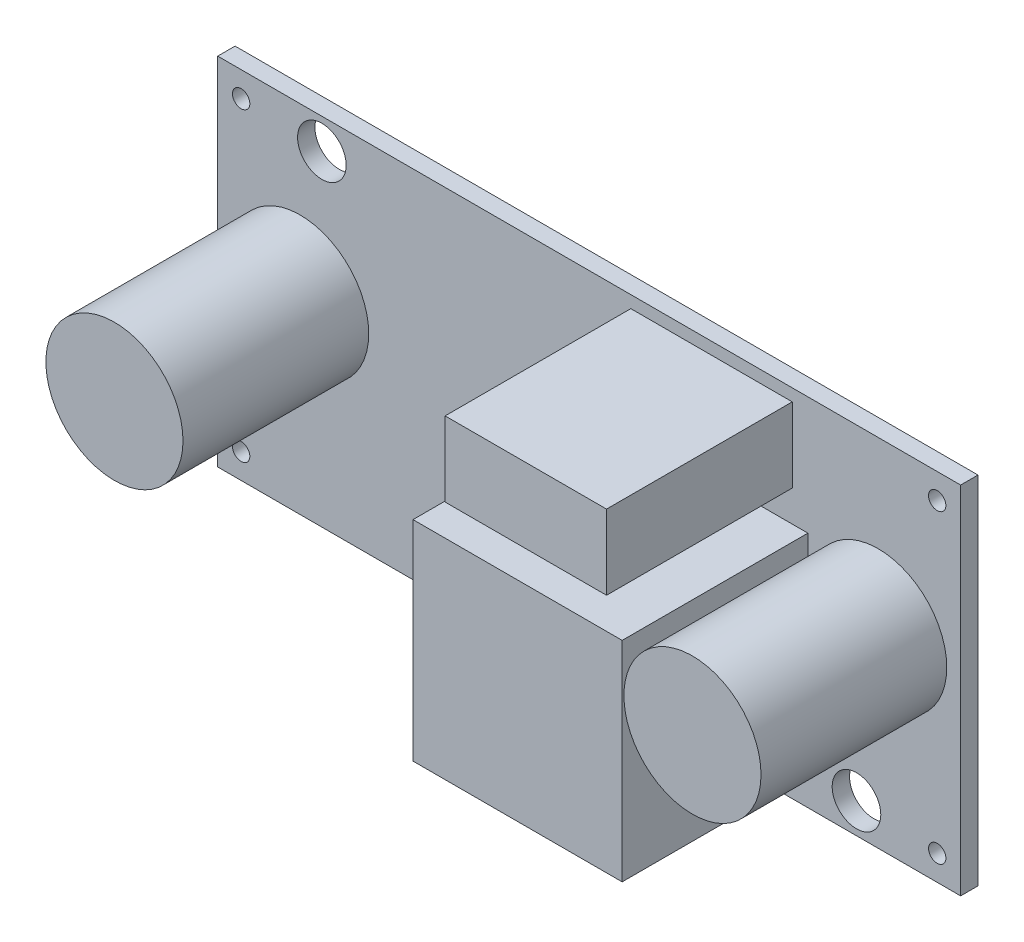
ISO-10303-21;
HEADER;
FILE_DESCRIPTION(('STEP AP214'),'2;1');
FILE_NAME('part.step','',(''),(''),'','','');
FILE_SCHEMA(('AUTOMOTIVE_DESIGN { 1 0 10303 214 1 1 1 1 }'));
ENDSEC;
DATA;
#1=APPLICATION_CONTEXT('core data for automotive mechanical design processes');
#2=APPLICATION_PROTOCOL_DEFINITION('international standard','automotive_design',2000,#1);
#3=PRODUCT_CONTEXT('',#1,'mechanical');
#4=PRODUCT('Part','Part','',(#3));
#5=PRODUCT_RELATED_PRODUCT_CATEGORY('part','',(#4));
#6=PRODUCT_DEFINITION_FORMATION('','',#4);
#7=PRODUCT_DEFINITION_CONTEXT('part definition',#1,'design');
#8=PRODUCT_DEFINITION('design','',#6,#7);
#9=PRODUCT_DEFINITION_SHAPE('','',#8);
#10=(LENGTH_UNIT() NAMED_UNIT(*) SI_UNIT(.MILLI.,.METRE.));
#11=(NAMED_UNIT(*) PLANE_ANGLE_UNIT() SI_UNIT($,.RADIAN.));
#12=(NAMED_UNIT(*) SI_UNIT($,.STERADIAN.) SOLID_ANGLE_UNIT());
#13=UNCERTAINTY_MEASURE_WITH_UNIT(LENGTH_MEASURE(1.E-05),#10,'distance_accuracy_value','');
#14=(GEOMETRIC_REPRESENTATION_CONTEXT(3) GLOBAL_UNCERTAINTY_ASSIGNED_CONTEXT((#13)) GLOBAL_UNIT_ASSIGNED_CONTEXT((#10,
#11,#12)) REPRESENTATION_CONTEXT('',''));
#15=CARTESIAN_POINT('',(0.,0.,0.));
#16=DIRECTION('',(0.,0.,1.));
#17=DIRECTION('',(1.,0.,0.));
#18=AXIS2_PLACEMENT_3D('',#15,#16,#17);
#19=CARTESIAN_POINT('',(0.,0.,1.));
#20=DIRECTION('',(0.,0.,1.));
#21=DIRECTION('',(1.,0.,0.));
#22=AXIS2_PLACEMENT_3D('',#19,#20,#21);
#23=PLANE('',#22);
#24=CARTESIAN_POINT('',(20.05,8.80000000000001,1.));
#25=DIRECTION('',(0.,0.,1.));
#26=DIRECTION('',(1.,0.,0.));
#27=AXIS2_PLACEMENT_3D('',#24,#25,#26);
#28=CIRCLE('',#27,0.499999999999999);
#29=CARTESIAN_POINT('',(20.55,8.80000000000001,1.));
#30=VERTEX_POINT('',#29);
#31=EDGE_CURVE('E398',#30,#30,#28,.T.);
#32=ORIENTED_EDGE('',*,*,#31,.F.);
#33=EDGE_LOOP('',(#32));
#34=FACE_BOUND('',#33,.T.);
#35=CARTESIAN_POINT('',(20.05,-8.8,1.));
#36=DIRECTION('',(0.,0.,1.));
#37=DIRECTION('',(1.,0.,0.));
#38=AXIS2_PLACEMENT_3D('',#35,#36,#37);
#39=CIRCLE('',#38,0.499999999999999);
#40=CARTESIAN_POINT('',(20.55,-8.8,1.));
#41=VERTEX_POINT('',#40);
#42=EDGE_CURVE('E390',#41,#41,#39,.T.);
#43=ORIENTED_EDGE('',*,*,#42,.F.);
#44=EDGE_LOOP('',(#43));
#45=FACE_BOUND('',#44,.T.);
#46=CARTESIAN_POINT('',(-20.05,-8.8,1.));
#47=DIRECTION('',(0.,0.,1.));
#48=DIRECTION('',(1.,0.,0.));
#49=AXIS2_PLACEMENT_3D('',#46,#47,#48);
#50=CIRCLE('',#49,0.499999999999999);
#51=CARTESIAN_POINT('',(-19.55,-8.8,1.));
#52=VERTEX_POINT('',#51);
#53=EDGE_CURVE('E383',#52,#52,#50,.T.);
#54=ORIENTED_EDGE('',*,*,#53,.F.);
#55=EDGE_LOOP('',(#54));
#56=FACE_BOUND('',#55,.T.);
#57=CARTESIAN_POINT('',(-20.05,8.8,1.));
#58=DIRECTION('',(0.,0.,1.));
#59=DIRECTION('',(1.,0.,0.));
#60=AXIS2_PLACEMENT_3D('',#57,#58,#59);
#61=CIRCLE('',#60,0.499999999999999);
#62=CARTESIAN_POINT('',(-19.55,8.8,1.));
#63=VERTEX_POINT('',#62);
#64=EDGE_CURVE('E385',#63,#63,#61,.T.);
#65=ORIENTED_EDGE('',*,*,#64,.F.);
#66=EDGE_LOOP('',(#65));
#67=FACE_BOUND('',#66,.T.);
#68=CARTESIAN_POINT('',(-16.65,0.750000000000004,1.));
#69=DIRECTION('',(0.,0.,1.));
#70=DIRECTION('',(1.,0.,0.));
#71=AXIS2_PLACEMENT_3D('',#68,#69,#70);
#72=CIRCLE('',#71,3.95);
#73=CARTESIAN_POINT('',(-12.7,0.750000000000004,1.));
#74=VERTEX_POINT('',#73);
#75=EDGE_CURVE('E200',#74,#74,#72,.T.);
#76=ORIENTED_EDGE('',*,*,#75,.F.);
#77=EDGE_LOOP('',(#76));
#78=FACE_BOUND('',#77,.T.);
#79=CARTESIAN_POINT('',(16.65,0.750000000000004,1.));
#80=DIRECTION('',(0.,0.,1.));
#81=DIRECTION('',(1.,0.,0.));
#82=AXIS2_PLACEMENT_3D('',#79,#80,#81);
#83=CIRCLE('',#82,3.95);
#84=CARTESIAN_POINT('',(20.6,0.750000000000004,1.));
#85=VERTEX_POINT('',#84);
#86=EDGE_CURVE('E203',#85,#85,#83,.T.);
#87=ORIENTED_EDGE('',*,*,#86,.F.);
#88=EDGE_LOOP('',(#87));
#89=FACE_BOUND('',#88,.T.);
#90=CARTESIAN_POINT('',(-15.4,8.5,1.));
#91=DIRECTION('',(0.,0.,1.));
#92=DIRECTION('',(1.,0.,0.));
#93=AXIS2_PLACEMENT_3D('',#90,#91,#92);
#94=CIRCLE('',#93,1.4);
#95=CARTESIAN_POINT('',(-14.,8.5,1.));
#96=VERTEX_POINT('',#95);
#97=EDGE_CURVE('E218',#96,#96,#94,.T.);
#98=ORIENTED_EDGE('',*,*,#97,.F.);
#99=EDGE_LOOP('',(#98));
#100=FACE_BOUND('',#99,.T.);
#101=DIRECTION('',(0.,-1.,0.));
#102=VECTOR('',#101,1.);
#103=CARTESIAN_POINT('',(-21.4,-10.25,1.));
#104=LINE('',#103,#102);
#105=CARTESIAN_POINT('',(-21.4,10.25,1.));
#106=VERTEX_POINT('',#105);
#107=CARTESIAN_POINT('',(-21.4,-10.25,1.));
#108=VERTEX_POINT('',#107);
#109=EDGE_CURVE('E224',#106,#108,#104,.T.);
#110=ORIENTED_EDGE('',*,*,#109,.T.);
#111=DIRECTION('',(1.,0.,0.));
#112=VECTOR('',#111,1.);
#113=CARTESIAN_POINT('',(21.4,-10.25,1.));
#114=LINE('',#113,#112);
#115=CARTESIAN_POINT('',(21.4,-10.25,1.));
#116=VERTEX_POINT('',#115);
#117=EDGE_CURVE('E227',#108,#116,#114,.T.);
#118=ORIENTED_EDGE('',*,*,#117,.T.);
#119=DIRECTION('',(0.,1.,0.));
#120=VECTOR('',#119,1.);
#121=CARTESIAN_POINT('',(21.4,-10.25,1.));
#122=LINE('',#121,#120);
#123=CARTESIAN_POINT('',(21.4,10.25,1.));
#124=VERTEX_POINT('',#123);
#125=EDGE_CURVE('E230',#116,#124,#122,.T.);
#126=ORIENTED_EDGE('',*,*,#125,.T.);
#127=DIRECTION('',(-1.,0.,0.));
#128=VECTOR('',#127,1.);
#129=CARTESIAN_POINT('',(21.4,10.25,1.));
#130=LINE('',#129,#128);
#131=EDGE_CURVE('E232',#124,#106,#130,.T.);
#132=ORIENTED_EDGE('',*,*,#131,.T.);
#133=EDGE_LOOP('',(#110,#118,#126,#132));
#134=FACE_BOUND('',#133,.T.);
#135=CARTESIAN_POINT('',(15.4,-8.5,1.));
#136=DIRECTION('',(0.,0.,1.));
#137=DIRECTION('',(1.,0.,0.));
#138=AXIS2_PLACEMENT_3D('',#135,#136,#137);
#139=CIRCLE('',#138,1.4);
#140=CARTESIAN_POINT('',(16.8,-8.5,1.));
#141=VERTEX_POINT('',#140);
#142=EDGE_CURVE('E212',#141,#141,#139,.T.);
#143=ORIENTED_EDGE('',*,*,#142,.F.);
#144=EDGE_LOOP('',(#143));
#145=FACE_BOUND('',#144,.T.);
#146=DIRECTION('',(1.,0.,0.));
#147=VECTOR('',#146,1.);
#148=CARTESIAN_POINT('',(11.7,5.25,1.));
#149=LINE('',#148,#147);
#150=CARTESIAN_POINT('',(2.39999999999999,5.25,1.));
#151=VERTEX_POINT('',#150);
#152=CARTESIAN_POINT('',(11.7,5.25,1.));
#153=VERTEX_POINT('',#152);
#154=EDGE_CURVE('E187',#151,#153,#149,.T.);
#155=ORIENTED_EDGE('',*,*,#154,.F.);
#156=DIRECTION('',(0.,-1.,0.));
#157=VECTOR('',#156,1.);
#158=CARTESIAN_POINT('',(2.39999999999999,9.55,1.));
#159=LINE('',#158,#157);
#160=CARTESIAN_POINT('',(2.39999999999999,9.55,1.));
#161=VERTEX_POINT('',#160);
#162=EDGE_CURVE('E189',#161,#151,#159,.T.);
#163=ORIENTED_EDGE('',*,*,#162,.F.);
#164=DIRECTION('',(-1.,0.,0.));
#165=VECTOR('',#164,1.);
#166=CARTESIAN_POINT('',(11.7,9.55,1.));
#167=LINE('',#166,#165);
#168=CARTESIAN_POINT('',(11.7,9.55,1.));
#169=VERTEX_POINT('',#168);
#170=EDGE_CURVE('E182',#169,#161,#167,.T.);
#171=ORIENTED_EDGE('',*,*,#170,.F.);
#172=DIRECTION('',(0.,1.,0.));
#173=VECTOR('',#172,1.);
#174=CARTESIAN_POINT('',(11.7,9.55,1.));
#175=LINE('',#174,#173);
#176=EDGE_CURVE('E184',#153,#169,#175,.T.);
#177=ORIENTED_EDGE('',*,*,#176,.F.);
#178=EDGE_LOOP('',(#155,#163,#171,#177));
#179=FACE_BOUND('',#178,.T.);
#180=DIRECTION('',(1.,0.,0.));
#181=VECTOR('',#180,1.);
#182=CARTESIAN_POINT('',(12.6,-8.6,1.));
#183=LINE('',#182,#181);
#184=CARTESIAN_POINT('',(0.549999999999993,-8.6,1.));
#185=VERTEX_POINT('',#184);
#186=CARTESIAN_POINT('',(12.6,-8.6,1.));
#187=VERTEX_POINT('',#186);
#188=EDGE_CURVE('E161',#185,#187,#183,.T.);
#189=ORIENTED_EDGE('',*,*,#188,.F.);
#190=DIRECTION('',(0.,-1.,0.));
#191=VECTOR('',#190,1.);
#192=CARTESIAN_POINT('',(0.549999999999991,3.45,1.));
#193=LINE('',#192,#191);
#194=CARTESIAN_POINT('',(0.549999999999991,3.45,1.));
#195=VERTEX_POINT('',#194);
#196=EDGE_CURVE('E156',#195,#185,#193,.T.);
#197=ORIENTED_EDGE('',*,*,#196,.F.);
#198=DIRECTION('',(-1.,0.,0.));
#199=VECTOR('',#198,1.);
#200=CARTESIAN_POINT('',(12.6,3.45,1.));
#201=LINE('',#200,#199);
#202=CARTESIAN_POINT('',(12.6,3.45,1.));
#203=VERTEX_POINT('',#202);
#204=EDGE_CURVE('E141',#203,#195,#201,.T.);
#205=ORIENTED_EDGE('',*,*,#204,.F.);
#206=DIRECTION('',(0.,1.,0.));
#207=VECTOR('',#206,1.);
#208=CARTESIAN_POINT('',(12.6,3.45,1.));
#209=LINE('',#208,#207);
#210=EDGE_CURVE('E149',#187,#203,#209,.T.);
#211=ORIENTED_EDGE('',*,*,#210,.F.);
#212=EDGE_LOOP('',(#189,#197,#205,#211));
#213=FACE_BOUND('',#212,.T.);
#214=ADVANCED_FACE('F51',(#34,#45,#56,#67,#78,#89,#100,#134,#145,#179,#213),#23,.T.);
#215=CARTESIAN_POINT('',(0.,0.,0.));
#216=DIRECTION('',(0.,0.,1.));
#217=DIRECTION('',(1.,0.,0.));
#218=AXIS2_PLACEMENT_3D('',#215,#216,#217);
#219=PLANE('',#218);
#220=CARTESIAN_POINT('',(20.05,8.80000000000001,0.));
#221=DIRECTION('',(0.,0.,1.));
#222=DIRECTION('',(1.,0.,0.));
#223=AXIS2_PLACEMENT_3D('',#220,#221,#222);
#224=CIRCLE('',#223,0.499999999999999);
#225=CARTESIAN_POINT('',(20.55,8.80000000000001,0.));
#226=VERTEX_POINT('',#225);
#227=EDGE_CURVE('E401',#226,#226,#224,.T.);
#228=ORIENTED_EDGE('',*,*,#227,.T.);
#229=EDGE_LOOP('',(#228));
#230=FACE_BOUND('',#229,.T.);
#231=CARTESIAN_POINT('',(20.05,-8.8,0.));
#232=DIRECTION('',(0.,0.,1.));
#233=DIRECTION('',(1.,0.,0.));
#234=AXIS2_PLACEMENT_3D('',#231,#232,#233);
#235=CIRCLE('',#234,0.499999999999999);
#236=CARTESIAN_POINT('',(20.55,-8.8,0.));
#237=VERTEX_POINT('',#236);
#238=EDGE_CURVE('E395',#237,#237,#235,.T.);
#239=ORIENTED_EDGE('',*,*,#238,.T.);
#240=EDGE_LOOP('',(#239));
#241=FACE_BOUND('',#240,.T.);
#242=CARTESIAN_POINT('',(-20.05,-8.8,0.));
#243=DIRECTION('',(0.,0.,1.));
#244=DIRECTION('',(1.,0.,0.));
#245=AXIS2_PLACEMENT_3D('',#242,#243,#244);
#246=CIRCLE('',#245,0.499999999999999);
#247=CARTESIAN_POINT('',(-19.55,-8.8,0.));
#248=VERTEX_POINT('',#247);
#249=EDGE_CURVE('E380',#248,#248,#246,.T.);
#250=ORIENTED_EDGE('',*,*,#249,.T.);
#251=EDGE_LOOP('',(#250));
#252=FACE_BOUND('',#251,.T.);
#253=CARTESIAN_POINT('',(-20.05,8.8,0.));
#254=DIRECTION('',(0.,0.,1.));
#255=DIRECTION('',(1.,0.,0.));
#256=AXIS2_PLACEMENT_3D('',#253,#254,#255);
#257=CIRCLE('',#256,0.499999999999999);
#258=CARTESIAN_POINT('',(-19.55,8.8,0.));
#259=VERTEX_POINT('',#258);
#260=EDGE_CURVE('E388',#259,#259,#257,.T.);
#261=ORIENTED_EDGE('',*,*,#260,.T.);
#262=EDGE_LOOP('',(#261));
#263=FACE_BOUND('',#262,.T.);
#264=DIRECTION('',(0.,-1.,0.));
#265=VECTOR('',#264,1.);
#266=CARTESIAN_POINT('',(-21.4,-10.25,0.));
#267=LINE('',#266,#265);
#268=CARTESIAN_POINT('',(-21.4,10.25,0.));
#269=VERTEX_POINT('',#268);
#270=CARTESIAN_POINT('',(-21.4,-10.25,0.));
#271=VERTEX_POINT('',#270);
#272=EDGE_CURVE('E221',#269,#271,#267,.T.);
#273=ORIENTED_EDGE('',*,*,#272,.F.);
#274=DIRECTION('',(-1.,0.,0.));
#275=VECTOR('',#274,1.);
#276=CARTESIAN_POINT('',(21.4,10.25,0.));
#277=LINE('',#276,#275);
#278=CARTESIAN_POINT('',(21.4,10.25,0.));
#279=VERTEX_POINT('',#278);
#280=EDGE_CURVE('E228',#279,#269,#277,.T.);
#281=ORIENTED_EDGE('',*,*,#280,.F.);
#282=DIRECTION('',(0.,1.,0.));
#283=VECTOR('',#282,1.);
#284=CARTESIAN_POINT('',(21.4,-10.25,0.));
#285=LINE('',#284,#283);
#286=CARTESIAN_POINT('',(21.4,-10.25,0.));
#287=VERTEX_POINT('',#286);
#288=EDGE_CURVE('E239',#287,#279,#285,.T.);
#289=ORIENTED_EDGE('',*,*,#288,.F.);
#290=DIRECTION('',(1.,0.,0.));
#291=VECTOR('',#290,1.);
#292=CARTESIAN_POINT('',(21.4,-10.25,0.));
#293=LINE('',#292,#291);
#294=EDGE_CURVE('E237',#271,#287,#293,.T.);
#295=ORIENTED_EDGE('',*,*,#294,.F.);
#296=EDGE_LOOP('',(#273,#281,#289,#295));
#297=FACE_BOUND('',#296,.T.);
#298=CARTESIAN_POINT('',(-15.4,8.5,0.));
#299=DIRECTION('',(0.,0.,1.));
#300=DIRECTION('',(1.,0.,0.));
#301=AXIS2_PLACEMENT_3D('',#298,#299,#300);
#302=CIRCLE('',#301,1.4);
#303=CARTESIAN_POINT('',(-14.,8.5,0.));
#304=VERTEX_POINT('',#303);
#305=EDGE_CURVE('E215',#304,#304,#302,.T.);
#306=ORIENTED_EDGE('',*,*,#305,.T.);
#307=EDGE_LOOP('',(#306));
#308=FACE_BOUND('',#307,.T.);
#309=CARTESIAN_POINT('',(15.4,-8.5,0.));
#310=DIRECTION('',(0.,0.,1.));
#311=DIRECTION('',(1.,0.,0.));
#312=AXIS2_PLACEMENT_3D('',#309,#310,#311);
#313=CIRCLE('',#312,1.4);
#314=CARTESIAN_POINT('',(16.8,-8.5,0.));
#315=VERTEX_POINT('',#314);
#316=EDGE_CURVE('E209',#315,#315,#313,.T.);
#317=ORIENTED_EDGE('',*,*,#316,.T.);
#318=EDGE_LOOP('',(#317));
#319=FACE_BOUND('',#318,.T.);
#320=ADVANCED_FACE('F257',(#230,#241,#252,#263,#297,#308,#319),#219,.F.);
#321=CARTESIAN_POINT('',(-21.4,-10.25,1.));
#322=DIRECTION('',(1.,0.,0.));
#323=DIRECTION('',(0.,0.,-1.));
#324=AXIS2_PLACEMENT_3D('',#321,#322,#323);
#325=PLANE('',#324);
#326=ORIENTED_EDGE('',*,*,#272,.T.);
#327=DIRECTION('',(0.,0.,-1.));
#328=VECTOR('',#327,1.);
#329=CARTESIAN_POINT('',(-21.4,-10.25,1.));
#330=LINE('',#329,#328);
#331=EDGE_CURVE('E11',#108,#271,#330,.T.);
#332=ORIENTED_EDGE('',*,*,#331,.F.);
#333=ORIENTED_EDGE('',*,*,#109,.F.);
#334=DIRECTION('',(0.,0.,-1.));
#335=VECTOR('',#334,1.);
#336=CARTESIAN_POINT('',(-21.4,10.25,1.));
#337=LINE('',#336,#335);
#338=EDGE_CURVE('E234',#106,#269,#337,.T.);
#339=ORIENTED_EDGE('',*,*,#338,.T.);
#340=EDGE_LOOP('',(#326,#332,#333,#339));
#341=FACE_BOUND('',#340,.T.);
#342=ADVANCED_FACE('F53',(#341),#325,.F.);
#343=CARTESIAN_POINT('',(21.4,-10.25,1.));
#344=DIRECTION('',(0.,1.,0.));
#345=DIRECTION('',(-1.,0.,0.));
#346=AXIS2_PLACEMENT_3D('',#343,#344,#345);
#347=PLANE('',#346);
#348=ORIENTED_EDGE('',*,*,#294,.T.);
#349=DIRECTION('',(0.,0.,-1.));
#350=VECTOR('',#349,1.);
#351=CARTESIAN_POINT('',(21.4,-10.25,1.));
#352=LINE('',#351,#350);
#353=EDGE_CURVE('E59',#116,#287,#352,.T.);
#354=ORIENTED_EDGE('',*,*,#353,.F.);
#355=ORIENTED_EDGE('',*,*,#117,.F.);
#356=ORIENTED_EDGE('',*,*,#331,.T.);
#357=EDGE_LOOP('',(#348,#354,#355,#356));
#358=FACE_BOUND('',#357,.T.);
#359=ADVANCED_FACE('F268',(#358),#347,.F.);
#360=CARTESIAN_POINT('',(21.4,-10.25,1.));
#361=DIRECTION('',(-1.,0.,0.));
#362=DIRECTION('',(0.,0.,1.));
#363=AXIS2_PLACEMENT_3D('',#360,#361,#362);
#364=PLANE('',#363);
#365=ORIENTED_EDGE('',*,*,#288,.T.);
#366=DIRECTION('',(0.,0.,-1.));
#367=VECTOR('',#366,1.);
#368=CARTESIAN_POINT('',(21.4,10.25,1.));
#369=LINE('',#368,#367);
#370=EDGE_CURVE('E244',#124,#279,#369,.T.);
#371=ORIENTED_EDGE('',*,*,#370,.F.);
#372=ORIENTED_EDGE('',*,*,#125,.F.);
#373=ORIENTED_EDGE('',*,*,#353,.T.);
#374=EDGE_LOOP('',(#365,#371,#372,#373));
#375=FACE_BOUND('',#374,.T.);
#376=ADVANCED_FACE('F251',(#375),#364,.F.);
#377=CARTESIAN_POINT('',(21.4,10.25,1.));
#378=DIRECTION('',(0.,-1.,0.));
#379=DIRECTION('',(1.,0.,0.));
#380=AXIS2_PLACEMENT_3D('',#377,#378,#379);
#381=PLANE('',#380);
#382=ORIENTED_EDGE('',*,*,#280,.T.);
#383=ORIENTED_EDGE('',*,*,#338,.F.);
#384=ORIENTED_EDGE('',*,*,#131,.F.);
#385=ORIENTED_EDGE('',*,*,#370,.T.);
#386=EDGE_LOOP('',(#382,#383,#384,#385));
#387=FACE_BOUND('',#386,.T.);
#388=ADVANCED_FACE('F261',(#387),#381,.F.);
#389=CARTESIAN_POINT('',(-15.4,8.5,1.));
#390=DIRECTION('',(0.,0.,-1.));
#391=DIRECTION('',(-1.,0.,0.));
#392=AXIS2_PLACEMENT_3D('',#389,#390,#391);
#393=CYLINDRICAL_SURFACE('',#392,1.4);
#394=ORIENTED_EDGE('',*,*,#97,.T.);
#395=EDGE_LOOP('',(#394));
#396=FACE_BOUND('',#395,.T.);
#397=ORIENTED_EDGE('',*,*,#305,.F.);
#398=EDGE_LOOP('',(#397));
#399=FACE_BOUND('',#398,.T.);
#400=ADVANCED_FACE('F286',(#396,#399),#393,.F.);
#401=CARTESIAN_POINT('',(15.4,-8.5,1.));
#402=DIRECTION('',(0.,0.,-1.));
#403=DIRECTION('',(-1.,0.,0.));
#404=AXIS2_PLACEMENT_3D('',#401,#402,#403);
#405=CYLINDRICAL_SURFACE('',#404,1.4);
#406=ORIENTED_EDGE('',*,*,#142,.T.);
#407=EDGE_LOOP('',(#406));
#408=FACE_BOUND('',#407,.T.);
#409=ORIENTED_EDGE('',*,*,#316,.F.);
#410=EDGE_LOOP('',(#409));
#411=FACE_BOUND('',#410,.T.);
#412=ADVANCED_FACE('F293',(#408,#411),#405,.F.);
#413=CARTESIAN_POINT('',(16.65,0.750000000000004,11.7));
#414=DIRECTION('',(0.,0.,-1.));
#415=DIRECTION('',(-1.,0.,0.));
#416=AXIS2_PLACEMENT_3D('',#413,#414,#415);
#417=CYLINDRICAL_SURFACE('',#416,3.95);
#418=CARTESIAN_POINT('',(16.65,0.750000000000004,11.7));
#419=DIRECTION('',(0.,0.,1.));
#420=DIRECTION('',(1.,0.,0.));
#421=AXIS2_PLACEMENT_3D('',#418,#419,#420);
#422=CIRCLE('',#421,3.95);
#423=CARTESIAN_POINT('',(20.6,0.750000000000004,11.7));
#424=VERTEX_POINT('',#423);
#425=EDGE_CURVE('E206',#424,#424,#422,.T.);
#426=ORIENTED_EDGE('',*,*,#425,.F.);
#427=EDGE_LOOP('',(#426));
#428=FACE_BOUND('',#427,.T.);
#429=ORIENTED_EDGE('',*,*,#86,.T.);
#430=EDGE_LOOP('',(#429));
#431=FACE_BOUND('',#430,.T.);
#432=ADVANCED_FACE('F298',(#428,#431),#417,.T.);
#433=CARTESIAN_POINT('',(16.65,0.750000000000004,11.7));
#434=DIRECTION('',(0.,0.,1.));
#435=DIRECTION('',(1.,0.,0.));
#436=AXIS2_PLACEMENT_3D('',#433,#434,#435);
#437=PLANE('',#436);
#438=ORIENTED_EDGE('',*,*,#425,.T.);
#439=EDGE_LOOP('',(#438));
#440=FACE_BOUND('',#439,.T.);
#441=ADVANCED_FACE('F310',(#440),#437,.T.);
#442=CARTESIAN_POINT('',(-16.65,0.750000000000004,11.7));
#443=DIRECTION('',(0.,0.,-1.));
#444=DIRECTION('',(-1.,0.,0.));
#445=AXIS2_PLACEMENT_3D('',#442,#443,#444);
#446=CYLINDRICAL_SURFACE('',#445,3.95);
#447=CARTESIAN_POINT('',(-16.65,0.750000000000004,11.7));
#448=DIRECTION('',(0.,0.,1.));
#449=DIRECTION('',(1.,0.,0.));
#450=AXIS2_PLACEMENT_3D('',#447,#448,#449);
#451=CIRCLE('',#450,3.95);
#452=CARTESIAN_POINT('',(-12.7,0.750000000000004,11.7));
#453=VERTEX_POINT('',#452);
#454=EDGE_CURVE('E192',#453,#453,#451,.T.);
#455=ORIENTED_EDGE('',*,*,#454,.F.);
#456=EDGE_LOOP('',(#455));
#457=FACE_BOUND('',#456,.T.);
#458=ORIENTED_EDGE('',*,*,#75,.T.);
#459=EDGE_LOOP('',(#458));
#460=FACE_BOUND('',#459,.T.);
#461=ADVANCED_FACE('F316',(#457,#460),#446,.T.);
#462=CARTESIAN_POINT('',(-16.65,0.750000000000004,11.7));
#463=DIRECTION('',(0.,0.,1.));
#464=DIRECTION('',(1.,0.,0.));
#465=AXIS2_PLACEMENT_3D('',#462,#463,#464);
#466=PLANE('',#465);
#467=ORIENTED_EDGE('',*,*,#454,.T.);
#468=EDGE_LOOP('',(#467));
#469=FACE_BOUND('',#468,.T.);
#470=ADVANCED_FACE('F318',(#469),#466,.T.);
#471=CARTESIAN_POINT('',(2.39999999999999,9.55,11.7));
#472=DIRECTION('',(1.,0.,0.));
#473=DIRECTION('',(0.,0.,-1.));
#474=AXIS2_PLACEMENT_3D('',#471,#472,#473);
#475=PLANE('',#474);
#476=ORIENTED_EDGE('',*,*,#162,.T.);
#477=DIRECTION('',(0.,0.,-1.));
#478=VECTOR('',#477,1.);
#479=CARTESIAN_POINT('',(2.39999999999999,5.25,11.7));
#480=LINE('',#479,#478);
#481=CARTESIAN_POINT('',(2.39999999999999,5.25,11.7));
#482=VERTEX_POINT('',#481);
#483=EDGE_CURVE('E162',#482,#151,#480,.T.);
#484=ORIENTED_EDGE('',*,*,#483,.F.);
#485=DIRECTION('',(0.,-1.,0.));
#486=VECTOR('',#485,1.);
#487=CARTESIAN_POINT('',(2.39999999999999,9.55,11.7));
#488=LINE('',#487,#486);
#489=CARTESIAN_POINT('',(2.39999999999999,9.55,11.7));
#490=VERTEX_POINT('',#489);
#491=EDGE_CURVE('E185',#490,#482,#488,.T.);
#492=ORIENTED_EDGE('',*,*,#491,.F.);
#493=DIRECTION('',(0.,0.,-1.));
#494=VECTOR('',#493,1.);
#495=CARTESIAN_POINT('',(2.39999999999999,9.55,11.7));
#496=LINE('',#495,#494);
#497=EDGE_CURVE('E178',#490,#161,#496,.T.);
#498=ORIENTED_EDGE('',*,*,#497,.T.);
#499=EDGE_LOOP('',(#476,#484,#492,#498));
#500=FACE_BOUND('',#499,.T.);
#501=ADVANCED_FACE('F321',(#500),#475,.F.);
#502=CARTESIAN_POINT('',(11.7,5.25,11.7));
#503=DIRECTION('',(0.,1.,0.));
#504=DIRECTION('',(-1.,0.,0.));
#505=AXIS2_PLACEMENT_3D('',#502,#503,#504);
#506=PLANE('',#505);
#507=ORIENTED_EDGE('',*,*,#154,.T.);
#508=DIRECTION('',(0.,0.,-1.));
#509=VECTOR('',#508,1.);
#510=CARTESIAN_POINT('',(11.7,5.25,11.7));
#511=LINE('',#510,#509);
#512=CARTESIAN_POINT('',(11.7,5.25,11.7));
#513=VERTEX_POINT('',#512);
#514=EDGE_CURVE('E164',#513,#153,#511,.T.);
#515=ORIENTED_EDGE('',*,*,#514,.F.);
#516=DIRECTION('',(1.,0.,0.));
#517=VECTOR('',#516,1.);
#518=CARTESIAN_POINT('',(11.7,5.25,11.7));
#519=LINE('',#518,#517);
#520=EDGE_CURVE('E196',#482,#513,#519,.T.);
#521=ORIENTED_EDGE('',*,*,#520,.F.);
#522=ORIENTED_EDGE('',*,*,#483,.T.);
#523=EDGE_LOOP('',(#507,#515,#521,#522));
#524=FACE_BOUND('',#523,.T.);
#525=ADVANCED_FACE('F336',(#524),#506,.F.);
#526=CARTESIAN_POINT('',(11.7,9.55,11.7));
#527=DIRECTION('',(-1.,0.,0.));
#528=DIRECTION('',(0.,0.,1.));
#529=AXIS2_PLACEMENT_3D('',#526,#527,#528);
#530=PLANE('',#529);
#531=ORIENTED_EDGE('',*,*,#176,.T.);
#532=DIRECTION('',(0.,0.,-1.));
#533=VECTOR('',#532,1.);
#534=CARTESIAN_POINT('',(11.7,9.55,11.7));
#535=LINE('',#534,#533);
#536=CARTESIAN_POINT('',(11.7,9.55,11.7));
#537=VERTEX_POINT('',#536);
#538=EDGE_CURVE('E74',#537,#169,#535,.T.);
#539=ORIENTED_EDGE('',*,*,#538,.F.);
#540=DIRECTION('',(0.,1.,0.));
#541=VECTOR('',#540,1.);
#542=CARTESIAN_POINT('',(11.7,9.55,11.7));
#543=LINE('',#542,#541);
#544=EDGE_CURVE('E194',#513,#537,#543,.T.);
#545=ORIENTED_EDGE('',*,*,#544,.F.);
#546=ORIENTED_EDGE('',*,*,#514,.T.);
#547=EDGE_LOOP('',(#531,#539,#545,#546));
#548=FACE_BOUND('',#547,.T.);
#549=ADVANCED_FACE('F333',(#548),#530,.F.);
#550=CARTESIAN_POINT('',(11.7,9.55,11.7));
#551=DIRECTION('',(0.,-1.,0.));
#552=DIRECTION('',(1.,0.,0.));
#553=AXIS2_PLACEMENT_3D('',#550,#551,#552);
#554=PLANE('',#553);
#555=ORIENTED_EDGE('',*,*,#170,.T.);
#556=ORIENTED_EDGE('',*,*,#497,.F.);
#557=DIRECTION('',(-1.,0.,0.));
#558=VECTOR('',#557,1.);
#559=CARTESIAN_POINT('',(11.7,9.55,11.7));
#560=LINE('',#559,#558);
#561=EDGE_CURVE('E181',#537,#490,#560,.T.);
#562=ORIENTED_EDGE('',*,*,#561,.F.);
#563=ORIENTED_EDGE('',*,*,#538,.T.);
#564=EDGE_LOOP('',(#555,#556,#562,#563));
#565=FACE_BOUND('',#564,.T.);
#566=ADVANCED_FACE('F329',(#565),#554,.F.);
#567=CARTESIAN_POINT('',(0.,0.,11.7));
#568=DIRECTION('',(0.,0.,-1.));
#569=DIRECTION('',(-1.,0.,0.));
#570=AXIS2_PLACEMENT_3D('',#567,#568,#569);
#571=PLANE('',#570);
#572=ORIENTED_EDGE('',*,*,#491,.T.);
#573=ORIENTED_EDGE('',*,*,#520,.T.);
#574=ORIENTED_EDGE('',*,*,#544,.T.);
#575=ORIENTED_EDGE('',*,*,#561,.T.);
#576=EDGE_LOOP('',(#572,#573,#574,#575));
#577=FACE_BOUND('',#576,.T.);
#578=ADVANCED_FACE('F326',(#577),#571,.F.);
#579=CARTESIAN_POINT('',(0.549999999999991,3.45,11.7));
#580=DIRECTION('',(1.,0.,0.));
#581=DIRECTION('',(0.,1.,0.));
#582=AXIS2_PLACEMENT_3D('',#579,#580,#581);
#583=PLANE('',#582);
#584=ORIENTED_EDGE('',*,*,#196,.T.);
#585=DIRECTION('',(0.,0.,-1.));
#586=VECTOR('',#585,1.);
#587=CARTESIAN_POINT('',(0.549999999999993,-8.6,11.7));
#588=LINE('',#587,#586);
#589=CARTESIAN_POINT('',(0.549999999999993,-8.6,11.7));
#590=VERTEX_POINT('',#589);
#591=EDGE_CURVE('E405',#590,#185,#588,.T.);
#592=ORIENTED_EDGE('',*,*,#591,.F.);
#593=DIRECTION('',(0.,-1.,0.));
#594=VECTOR('',#593,1.);
#595=CARTESIAN_POINT('',(0.549999999999991,3.45,11.7));
#596=LINE('',#595,#594);
#597=CARTESIAN_POINT('',(0.549999999999991,3.45,11.7));
#598=VERTEX_POINT('',#597);
#599=EDGE_CURVE('E150',#598,#590,#596,.T.);
#600=ORIENTED_EDGE('',*,*,#599,.F.);
#601=DIRECTION('',(0.,0.,-1.));
#602=VECTOR('',#601,1.);
#603=CARTESIAN_POINT('',(0.549999999999991,3.45,11.7));
#604=LINE('',#603,#602);
#605=EDGE_CURVE('E144',#598,#195,#604,.T.);
#606=ORIENTED_EDGE('',*,*,#605,.T.);
#607=EDGE_LOOP('',(#584,#592,#600,#606));
#608=FACE_BOUND('',#607,.T.);
#609=ADVANCED_FACE('F154',(#608),#583,.F.);
#610=CARTESIAN_POINT('',(12.6,-8.6,11.7));
#611=DIRECTION('',(0.,1.,0.));
#612=DIRECTION('',(-1.,0.,0.));
#613=AXIS2_PLACEMENT_3D('',#610,#611,#612);
#614=PLANE('',#613);
#615=ORIENTED_EDGE('',*,*,#188,.T.);
#616=DIRECTION('',(0.,0.,-1.));
#617=VECTOR('',#616,1.);
#618=CARTESIAN_POINT('',(12.6,-8.6,11.7));
#619=LINE('',#618,#617);
#620=CARTESIAN_POINT('',(12.6,-8.6,11.7));
#621=VERTEX_POINT('',#620);
#622=EDGE_CURVE('E408',#621,#187,#619,.T.);
#623=ORIENTED_EDGE('',*,*,#622,.F.);
#624=DIRECTION('',(1.,0.,0.));
#625=VECTOR('',#624,1.);
#626=CARTESIAN_POINT('',(12.6,-8.6,11.7));
#627=LINE('',#626,#625);
#628=EDGE_CURVE('E172',#590,#621,#627,.T.);
#629=ORIENTED_EDGE('',*,*,#628,.F.);
#630=ORIENTED_EDGE('',*,*,#591,.T.);
#631=EDGE_LOOP('',(#615,#623,#629,#630));
#632=FACE_BOUND('',#631,.T.);
#633=ADVANCED_FACE('F354',(#632),#614,.F.);
#634=CARTESIAN_POINT('',(12.6,3.45,11.7));
#635=DIRECTION('',(-1.,0.,0.));
#636=DIRECTION('',(0.,-1.,0.));
#637=AXIS2_PLACEMENT_3D('',#634,#635,#636);
#638=PLANE('',#637);
#639=ORIENTED_EDGE('',*,*,#210,.T.);
#640=DIRECTION('',(0.,0.,-1.));
#641=VECTOR('',#640,1.);
#642=CARTESIAN_POINT('',(12.6,3.45,11.7));
#643=LINE('',#642,#641);
#644=CARTESIAN_POINT('',(12.6,3.45,11.7));
#645=VERTEX_POINT('',#644);
#646=EDGE_CURVE('E66',#645,#203,#643,.T.);
#647=ORIENTED_EDGE('',*,*,#646,.F.);
#648=DIRECTION('',(0.,1.,0.));
#649=VECTOR('',#648,1.);
#650=CARTESIAN_POINT('',(12.6,3.45,11.7));
#651=LINE('',#650,#649);
#652=EDGE_CURVE('E170',#621,#645,#651,.T.);
#653=ORIENTED_EDGE('',*,*,#652,.F.);
#654=ORIENTED_EDGE('',*,*,#622,.T.);
#655=EDGE_LOOP('',(#639,#647,#653,#654));
#656=FACE_BOUND('',#655,.T.);
#657=ADVANCED_FACE('F351',(#656),#638,.F.);
#658=CARTESIAN_POINT('',(12.6,3.45,11.7));
#659=DIRECTION('',(0.,-1.,0.));
#660=DIRECTION('',(1.,0.,0.));
#661=AXIS2_PLACEMENT_3D('',#658,#659,#660);
#662=PLANE('',#661);
#663=ORIENTED_EDGE('',*,*,#204,.T.);
#664=ORIENTED_EDGE('',*,*,#605,.F.);
#665=DIRECTION('',(-1.,0.,0.));
#666=VECTOR('',#665,1.);
#667=CARTESIAN_POINT('',(12.6,3.45,11.7));
#668=LINE('',#667,#666);
#669=EDGE_CURVE('E159',#645,#598,#668,.T.);
#670=ORIENTED_EDGE('',*,*,#669,.F.);
#671=ORIENTED_EDGE('',*,*,#646,.T.);
#672=EDGE_LOOP('',(#663,#664,#670,#671));
#673=FACE_BOUND('',#672,.T.);
#674=ADVANCED_FACE('F143',(#673),#662,.F.);
#675=CARTESIAN_POINT('',(0.,0.,11.7));
#676=DIRECTION('',(0.,0.,-1.));
#677=DIRECTION('',(-1.,0.,0.));
#678=AXIS2_PLACEMENT_3D('',#675,#676,#677);
#679=PLANE('',#678);
#680=ORIENTED_EDGE('',*,*,#599,.T.);
#681=ORIENTED_EDGE('',*,*,#628,.T.);
#682=ORIENTED_EDGE('',*,*,#652,.T.);
#683=ORIENTED_EDGE('',*,*,#669,.T.);
#684=EDGE_LOOP('',(#680,#681,#682,#683));
#685=FACE_BOUND('',#684,.T.);
#686=ADVANCED_FACE('F344',(#685),#679,.F.);
#687=CARTESIAN_POINT('',(-20.05,8.8,0.));
#688=DIRECTION('',(0.,0.,1.));
#689=DIRECTION('',(1.,0.,0.));
#690=AXIS2_PLACEMENT_3D('',#687,#688,#689);
#691=CYLINDRICAL_SURFACE('',#690,0.499999999999999);
#692=ORIENTED_EDGE('',*,*,#260,.F.);
#693=EDGE_LOOP('',(#692));
#694=FACE_BOUND('',#693,.T.);
#695=ORIENTED_EDGE('',*,*,#64,.T.);
#696=EDGE_LOOP('',(#695));
#697=FACE_BOUND('',#696,.T.);
#698=ADVANCED_FACE('F347',(#694,#697),#691,.F.);
#699=CARTESIAN_POINT('',(-20.05,-8.8,0.));
#700=DIRECTION('',(0.,0.,1.));
#701=DIRECTION('',(1.,0.,0.));
#702=AXIS2_PLACEMENT_3D('',#699,#700,#701);
#703=CYLINDRICAL_SURFACE('',#702,0.499999999999999);
#704=ORIENTED_EDGE('',*,*,#249,.F.);
#705=EDGE_LOOP('',(#704));
#706=FACE_BOUND('',#705,.T.);
#707=ORIENTED_EDGE('',*,*,#53,.T.);
#708=EDGE_LOOP('',(#707));
#709=FACE_BOUND('',#708,.T.);
#710=ADVANCED_FACE('F363',(#706,#709),#703,.F.);
#711=CARTESIAN_POINT('',(20.05,-8.8,0.));
#712=DIRECTION('',(0.,0.,1.));
#713=DIRECTION('',(1.,0.,0.));
#714=AXIS2_PLACEMENT_3D('',#711,#712,#713);
#715=CYLINDRICAL_SURFACE('',#714,0.499999999999999);
#716=ORIENTED_EDGE('',*,*,#238,.F.);
#717=EDGE_LOOP('',(#716));
#718=FACE_BOUND('',#717,.T.);
#719=ORIENTED_EDGE('',*,*,#42,.T.);
#720=EDGE_LOOP('',(#719));
#721=FACE_BOUND('',#720,.T.);
#722=ADVANCED_FACE('F368',(#718,#721),#715,.F.);
#723=CARTESIAN_POINT('',(20.05,8.80000000000001,0.));
#724=DIRECTION('',(0.,0.,1.));
#725=DIRECTION('',(1.,0.,0.));
#726=AXIS2_PLACEMENT_3D('',#723,#724,#725);
#727=CYLINDRICAL_SURFACE('',#726,0.499999999999999);
#728=ORIENTED_EDGE('',*,*,#227,.F.);
#729=EDGE_LOOP('',(#728));
#730=FACE_BOUND('',#729,.T.);
#731=ORIENTED_EDGE('',*,*,#31,.T.);
#732=EDGE_LOOP('',(#731));
#733=FACE_BOUND('',#732,.T.);
#734=ADVANCED_FACE('F365',(#730,#733),#727,.F.);
#735=CLOSED_SHELL('',(#214,#320,#342,#359,#376,#388,#400,#412,#432,#441,#461,#470,#501,#525,
#549,#566,#578,#609,#633,#657,#674,#686,#698,#710,#722,#734));
#736=MANIFOLD_SOLID_BREP('B2',#735);
#737=ADVANCED_BREP_SHAPE_REPRESENTATION('',(#18,#736),#14);
#738=SHAPE_DEFINITION_REPRESENTATION(#9,#737);
ENDSEC;
END-ISO-10303-21;
